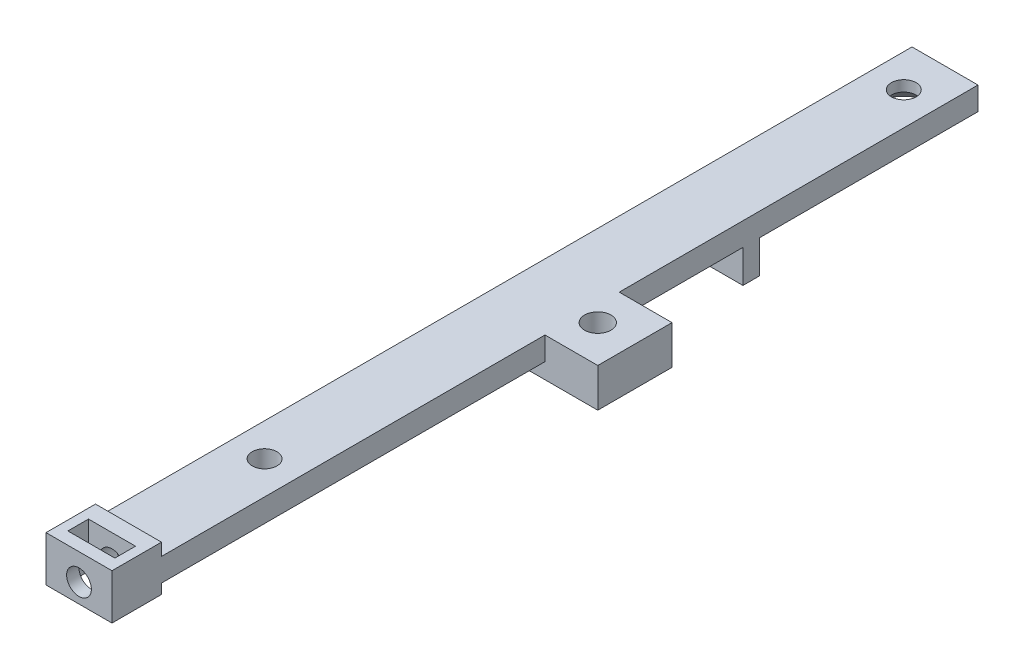
ISO-10303-21;
HEADER;
FILE_DESCRIPTION(('STEP AP214'),'2;1');
FILE_NAME('part.step','',(''),(''),'','','');
FILE_SCHEMA(('AUTOMOTIVE_DESIGN { 1 0 10303 214 1 1 1 1 }'));
ENDSEC;
DATA;
#1=APPLICATION_CONTEXT('core data for automotive mechanical design processes');
#2=APPLICATION_PROTOCOL_DEFINITION('international standard','automotive_design',2000,#1);
#3=PRODUCT_CONTEXT('',#1,'mechanical');
#4=PRODUCT('Part','Part','',(#3));
#5=PRODUCT_RELATED_PRODUCT_CATEGORY('part','',(#4));
#6=PRODUCT_DEFINITION_FORMATION('','',#4);
#7=PRODUCT_DEFINITION_CONTEXT('part definition',#1,'design');
#8=PRODUCT_DEFINITION('design','',#6,#7);
#9=PRODUCT_DEFINITION_SHAPE('','',#8);
#10=(LENGTH_UNIT() NAMED_UNIT(*) SI_UNIT(.MILLI.,.METRE.));
#11=(NAMED_UNIT(*) PLANE_ANGLE_UNIT() SI_UNIT($,.RADIAN.));
#12=(NAMED_UNIT(*) SI_UNIT($,.STERADIAN.) SOLID_ANGLE_UNIT());
#13=UNCERTAINTY_MEASURE_WITH_UNIT(LENGTH_MEASURE(1.E-05),#10,'distance_accuracy_value','');
#14=(GEOMETRIC_REPRESENTATION_CONTEXT(3) GLOBAL_UNCERTAINTY_ASSIGNED_CONTEXT((#13)) GLOBAL_UNIT_ASSIGNED_CONTEXT((#10,
#11,#12)) REPRESENTATION_CONTEXT('',''));
#15=CARTESIAN_POINT('',(0.,0.,0.));
#16=DIRECTION('',(0.,0.,1.));
#17=DIRECTION('',(1.,0.,0.));
#18=AXIS2_PLACEMENT_3D('',#15,#16,#17);
#19=CARTESIAN_POINT('',(0.,0.,0.));
#20=DIRECTION('',(0.,-1.,0.));
#21=DIRECTION('',(0.,0.,-1.));
#22=AXIS2_PLACEMENT_3D('',#19,#20,#21);
#23=PLANE('',#22);
#24=DIRECTION('',(0.,0.,1.));
#25=VECTOR('',#24,1.);
#26=CARTESIAN_POINT('',(0.,0.,0.));
#27=LINE('',#26,#25);
#28=CARTESIAN_POINT('',(0.,0.,-76.5));
#29=VERTEX_POINT('',#28);
#30=CARTESIAN_POINT('',(0.,0.,-61.5));
#31=VERTEX_POINT('',#30);
#32=EDGE_CURVE('E363',#29,#31,#27,.T.);
#33=ORIENTED_EDGE('',*,*,#32,.F.);
#34=DIRECTION('',(-1.,0.,0.));
#35=VECTOR('',#34,1.);
#36=CARTESIAN_POINT('',(8.,0.,-76.5));
#37=LINE('',#36,#35);
#38=CARTESIAN_POINT('',(8.,0.,-76.5));
#39=VERTEX_POINT('',#38);
#40=EDGE_CURVE('E448',#39,#29,#37,.T.);
#41=ORIENTED_EDGE('',*,*,#40,.F.);
#42=DIRECTION('',(0.,0.,-1.));
#43=VECTOR('',#42,1.);
#44=CARTESIAN_POINT('',(8.,0.,-55.));
#45=LINE('',#44,#43);
#46=CARTESIAN_POINT('',(8.,0.,-61.5));
#47=VERTEX_POINT('',#46);
#48=EDGE_CURVE('E214',#47,#39,#45,.T.);
#49=ORIENTED_EDGE('',*,*,#48,.F.);
#50=DIRECTION('',(1.,0.,0.));
#51=VECTOR('',#50,1.);
#52=CARTESIAN_POINT('',(0.,0.,-61.5));
#53=LINE('',#52,#51);
#54=EDGE_CURVE('E262',#31,#47,#53,.T.);
#55=ORIENTED_EDGE('',*,*,#54,.F.);
#56=EDGE_LOOP('',(#33,#41,#49,#55));
#57=FACE_BOUND('',#56,.T.);
#58=ADVANCED_FACE('F32',(#57),#23,.T.);
#59=CARTESIAN_POINT('',(4.,0.,-100.));
#60=DIRECTION('',(0.,-1.,0.));
#61=DIRECTION('',(0.,0.,-1.));
#62=AXIS2_PLACEMENT_3D('',#59,#60,#61);
#63=CIRCLE('',#62,2.99999999999999);
#64=CARTESIAN_POINT('',(4.,0.,-103.));
#65=VERTEX_POINT('',#64);
#66=EDGE_CURVE('E373',#65,#65,#63,.F.);
#67=ORIENTED_EDGE('',*,*,#66,.T.);
#68=EDGE_LOOP('',(#67));
#69=FACE_BOUND('',#68,.T.);
#70=CARTESIAN_POINT('',(8.,0.,-78.5));
#71=VERTEX_POINT('',#70);
#72=CARTESIAN_POINT('',(8.,0.,-105.));
#73=VERTEX_POINT('',#72);
#74=EDGE_CURVE('E343',#71,#73,#45,.T.);
#75=ORIENTED_EDGE('',*,*,#74,.F.);
#76=DIRECTION('',(1.,0.,0.));
#77=VECTOR('',#76,1.);
#78=CARTESIAN_POINT('',(8.,0.,-78.5));
#79=LINE('',#78,#77);
#80=CARTESIAN_POINT('',(0.,0.,-78.5));
#81=VERTEX_POINT('',#80);
#82=EDGE_CURVE('E207',#81,#71,#79,.T.);
#83=ORIENTED_EDGE('',*,*,#82,.F.);
#84=CARTESIAN_POINT('',(0.,0.,-105.));
#85=VERTEX_POINT('',#84);
#86=EDGE_CURVE('E360',#85,#81,#27,.T.);
#87=ORIENTED_EDGE('',*,*,#86,.F.);
#88=DIRECTION('',(-1.,0.,0.));
#89=VECTOR('',#88,1.);
#90=CARTESIAN_POINT('',(0.,0.,-105.));
#91=LINE('',#90,#89);
#92=EDGE_CURVE('E356',#73,#85,#91,.T.);
#93=ORIENTED_EDGE('',*,*,#92,.F.);
#94=EDGE_LOOP('',(#75,#83,#87,#93));
#95=FACE_BOUND('',#94,.T.);
#96=ADVANCED_FACE('F402',(#69,#95),#23,.T.);
#97=CARTESIAN_POINT('',(4.,0.,-22.5));
#98=DIRECTION('',(0.,-1.,0.));
#99=DIRECTION('',(0.,0.,-1.));
#100=AXIS2_PLACEMENT_3D('',#97,#98,#99);
#101=CIRCLE('',#100,1.5);
#102=CARTESIAN_POINT('',(4.,0.,-24.));
#103=VERTEX_POINT('',#102);
#104=EDGE_CURVE('E215',#103,#103,#101,.F.);
#105=ORIENTED_EDGE('',*,*,#104,.T.);
#106=EDGE_LOOP('',(#105));
#107=FACE_BOUND('',#106,.T.);
#108=DIRECTION('',(-1.,0.,0.));
#109=VECTOR('',#108,1.);
#110=CARTESIAN_POINT('',(0.,0.,-52.5));
#111=LINE('',#110,#109);
#112=CARTESIAN_POINT('',(8.,0.,-52.5));
#113=VERTEX_POINT('',#112);
#114=CARTESIAN_POINT('',(0.,0.,-52.5));
#115=VERTEX_POINT('',#114);
#116=EDGE_CURVE('E267',#113,#115,#111,.T.);
#117=ORIENTED_EDGE('',*,*,#116,.F.);
#118=CARTESIAN_POINT('',(8.00000000000001,0.,-6.));
#119=VERTEX_POINT('',#118);
#120=EDGE_CURVE('E353',#119,#113,#45,.T.);
#121=ORIENTED_EDGE('',*,*,#120,.F.);
#122=DIRECTION('',(-1.,0.,0.));
#123=VECTOR('',#122,1.);
#124=CARTESIAN_POINT('',(0.,0.,-6.));
#125=LINE('',#124,#123);
#126=CARTESIAN_POINT('',(5.01980390271856,0.,-6.));
#127=VERTEX_POINT('',#126);
#128=EDGE_CURVE('E11',#119,#127,#125,.T.);
#129=ORIENTED_EDGE('',*,*,#128,.T.);
#130=CARTESIAN_POINT('',(2.98019609728145,0.,-6.));
#131=VERTEX_POINT('',#130);
#132=EDGE_CURVE('E41',#127,#131,#125,.T.);
#133=ORIENTED_EDGE('',*,*,#132,.T.);
#134=CARTESIAN_POINT('',(0.,0.,-6.));
#135=VERTEX_POINT('',#134);
#136=EDGE_CURVE('E43',#131,#135,#125,.T.);
#137=ORIENTED_EDGE('',*,*,#136,.T.);
#138=EDGE_CURVE('E359',#115,#135,#27,.T.);
#139=ORIENTED_EDGE('',*,*,#138,.F.);
#140=EDGE_LOOP('',(#117,#121,#129,#133,#137,#139));
#141=FACE_BOUND('',#140,.T.);
#142=ADVANCED_FACE('F405',(#107,#141),#23,.T.);
#143=CARTESIAN_POINT('',(8.,2.8,-55.));
#144=DIRECTION('',(-1.,0.,0.));
#145=DIRECTION('',(0.,0.,1.));
#146=AXIS2_PLACEMENT_3D('',#143,#144,#145);
#147=PLANE('',#146);
#148=ORIENTED_EDGE('',*,*,#120,.T.);
#149=DIRECTION('',(0.,1.,0.));
#150=VECTOR('',#149,1.);
#151=CARTESIAN_POINT('',(8.,2.8,-52.5));
#152=LINE('',#151,#150);
#153=CARTESIAN_POINT('',(8.,2.8,-52.5));
#154=VERTEX_POINT('',#153);
#155=EDGE_CURVE('E264',#113,#154,#152,.T.);
#156=ORIENTED_EDGE('',*,*,#155,.T.);
#157=DIRECTION('',(0.,0.,-1.));
#158=VECTOR('',#157,1.);
#159=CARTESIAN_POINT('',(8.00000000000001,2.8,0.));
#160=LINE('',#159,#158);
#161=CARTESIAN_POINT('',(8.00000000000001,2.8,-6.));
#162=VERTEX_POINT('',#161);
#163=EDGE_CURVE('E344',#162,#154,#160,.T.);
#164=ORIENTED_EDGE('',*,*,#163,.F.);
#165=DIRECTION('',(0.,1.,0.));
#166=VECTOR('',#165,1.);
#167=CARTESIAN_POINT('',(8.00000000000001,-1.2,-6.));
#168=LINE('',#167,#166);
#169=CARTESIAN_POINT('',(8.00000000000001,4.3,-6.));
#170=VERTEX_POINT('',#169);
#171=EDGE_CURVE('E329',#162,#170,#168,.T.);
#172=ORIENTED_EDGE('',*,*,#171,.T.);
#173=DIRECTION('',(0.,0.,1.));
#174=VECTOR('',#173,1.);
#175=CARTESIAN_POINT('',(8.00000000000001,4.3,0.));
#176=LINE('',#175,#174);
#177=CARTESIAN_POINT('',(8.00000000000001,4.3,0.));
#178=VERTEX_POINT('',#177);
#179=EDGE_CURVE('E312',#170,#178,#176,.T.);
#180=ORIENTED_EDGE('',*,*,#179,.T.);
#181=DIRECTION('',(0.,-1.,0.));
#182=VECTOR('',#181,1.);
#183=CARTESIAN_POINT('',(8.00000000000001,2.8,0.));
#184=LINE('',#183,#182);
#185=CARTESIAN_POINT('',(8.00000000000001,-1.2,0.));
#186=VERTEX_POINT('',#185);
#187=EDGE_CURVE('E371',#178,#186,#184,.T.);
#188=ORIENTED_EDGE('',*,*,#187,.T.);
#189=DIRECTION('',(0.,0.,1.));
#190=VECTOR('',#189,1.);
#191=CARTESIAN_POINT('',(8.00000000000001,-1.2,0.));
#192=LINE('',#191,#190);
#193=CARTESIAN_POINT('',(8.00000000000001,-1.2,-6.));
#194=VERTEX_POINT('',#193);
#195=EDGE_CURVE('E323',#194,#186,#192,.T.);
#196=ORIENTED_EDGE('',*,*,#195,.F.);
#197=EDGE_CURVE('E330',#194,#119,#168,.T.);
#198=ORIENTED_EDGE('',*,*,#197,.T.);
#199=EDGE_LOOP('',(#148,#156,#164,#172,#180,#188,#196,#198));
#200=FACE_BOUND('',#199,.T.);
#201=ADVANCED_FACE('F414',(#200),#147,.F.);
#202=CARTESIAN_POINT('',(4.,1.1,-10.2426406871193));
#203=DIRECTION('',(0.,0.,1.));
#204=DIRECTION('',(1.,0.,0.));
#205=AXIS2_PLACEMENT_3D('',#202,#203,#204);
#206=CYLINDRICAL_SURFACE('',#205,1.5);
#207=CARTESIAN_POINT('',(4.,1.1,-4.));
#208=DIRECTION('',(0.,0.,-1.));
#209=DIRECTION('',(-1.,0.,0.));
#210=AXIS2_PLACEMENT_3D('',#207,#208,#209);
#211=CIRCLE('',#210,1.5);
#212=CARTESIAN_POINT('',(2.5,1.1,-4.));
#213=VERTEX_POINT('',#212);
#214=EDGE_CURVE('E36',#213,#213,#211,.F.);
#215=ORIENTED_EDGE('',*,*,#214,.T.);
#216=EDGE_LOOP('',(#215));
#217=FACE_BOUND('',#216,.T.);
#218=CARTESIAN_POINT('',(4.,1.1,-6.));
#219=DIRECTION('',(0.,0.,1.));
#220=DIRECTION('',(1.,0.,0.));
#221=AXIS2_PLACEMENT_3D('',#218,#219,#220);
#222=CIRCLE('',#221,1.5);
#223=EDGE_CURVE('E303',#127,#131,#222,.F.);
#224=ORIENTED_EDGE('',*,*,#223,.T.);
#225=EDGE_CURVE('E302',#131,#127,#222,.F.);
#226=ORIENTED_EDGE('',*,*,#225,.T.);
#227=EDGE_LOOP('',(#224,#226));
#228=FACE_BOUND('',#227,.T.);
#229=ADVANCED_FACE('F419',(#217,#228),#206,.F.);
#230=CARTESIAN_POINT('',(0.,2.8,0.));
#231=DIRECTION('',(0.,-1.,0.));
#232=DIRECTION('',(0.,0.,-1.));
#233=AXIS2_PLACEMENT_3D('',#230,#231,#232);
#234=PLANE('',#233);
#235=CARTESIAN_POINT('',(4.,2.8,-22.5));
#236=DIRECTION('',(0.,-1.,0.));
#237=DIRECTION('',(0.,0.,-1.));
#238=AXIS2_PLACEMENT_3D('',#235,#236,#237);
#239=CIRCLE('',#238,1.5);
#240=CARTESIAN_POINT('',(4.,2.8,-24.));
#241=VERTEX_POINT('',#240);
#242=EDGE_CURVE('E218',#241,#241,#239,.F.);
#243=ORIENTED_EDGE('',*,*,#242,.F.);
#244=EDGE_LOOP('',(#243));
#245=FACE_BOUND('',#244,.T.);
#246=CARTESIAN_POINT('',(9.90000000000001,2.8,-57.));
#247=DIRECTION('',(0.,-1.,0.));
#248=DIRECTION('',(0.,0.,-1.));
#249=AXIS2_PLACEMENT_3D('',#246,#247,#248);
#250=CIRCLE('',#249,1.6);
#251=CARTESIAN_POINT('',(9.90000000000001,2.8,-58.6));
#252=VERTEX_POINT('',#251);
#253=EDGE_CURVE('E229',#252,#252,#250,.F.);
#254=ORIENTED_EDGE('',*,*,#253,.F.);
#255=EDGE_LOOP('',(#254));
#256=FACE_BOUND('',#255,.T.);
#257=CARTESIAN_POINT('',(4.,2.8,-100.));
#258=DIRECTION('',(0.,1.,0.));
#259=DIRECTION('',(0.,0.,1.));
#260=AXIS2_PLACEMENT_3D('',#257,#258,#259);
#261=CIRCLE('',#260,1.5);
#262=CARTESIAN_POINT('',(4.,2.8,-98.5));
#263=VERTEX_POINT('',#262);
#264=EDGE_CURVE('E340',#263,#263,#261,.T.);
#265=ORIENTED_EDGE('',*,*,#264,.F.);
#266=EDGE_LOOP('',(#265));
#267=FACE_BOUND('',#266,.T.);
#268=DIRECTION('',(0.,0.,1.));
#269=VECTOR('',#268,1.);
#270=CARTESIAN_POINT('',(0.,2.8,-55.));
#271=LINE('',#270,#269);
#272=CARTESIAN_POINT('',(0.,2.8,-105.));
#273=VERTEX_POINT('',#272);
#274=CARTESIAN_POINT('',(0.,2.8,-6.));
#275=VERTEX_POINT('',#274);
#276=EDGE_CURVE('E350',#273,#275,#271,.T.);
#277=ORIENTED_EDGE('',*,*,#276,.T.);
#278=DIRECTION('',(-1.,0.,0.));
#279=VECTOR('',#278,1.);
#280=CARTESIAN_POINT('',(0.,2.8,-6.));
#281=LINE('',#280,#279);
#282=EDGE_CURVE('E337',#162,#275,#281,.T.);
#283=ORIENTED_EDGE('',*,*,#282,.F.);
#284=ORIENTED_EDGE('',*,*,#163,.T.);
#285=DIRECTION('',(1.,0.,0.));
#286=VECTOR('',#285,1.);
#287=CARTESIAN_POINT('',(14.4,2.8,-52.5));
#288=LINE('',#287,#286);
#289=CARTESIAN_POINT('',(14.4,2.8,-52.5));
#290=VERTEX_POINT('',#289);
#291=EDGE_CURVE('E237',#154,#290,#288,.T.);
#292=ORIENTED_EDGE('',*,*,#291,.T.);
#293=DIRECTION('',(0.,0.,-1.));
#294=VECTOR('',#293,1.);
#295=CARTESIAN_POINT('',(14.4,2.8,-61.5));
#296=LINE('',#295,#294);
#297=CARTESIAN_POINT('',(14.4,2.8,-61.5));
#298=VERTEX_POINT('',#297);
#299=EDGE_CURVE('E232',#290,#298,#296,.T.);
#300=ORIENTED_EDGE('',*,*,#299,.T.);
#301=DIRECTION('',(-1.,0.,0.));
#302=VECTOR('',#301,1.);
#303=CARTESIAN_POINT('',(14.4,2.8,-61.5));
#304=LINE('',#303,#302);
#305=CARTESIAN_POINT('',(8.,2.8,-61.5));
#306=VERTEX_POINT('',#305);
#307=EDGE_CURVE('E58',#298,#306,#304,.T.);
#308=ORIENTED_EDGE('',*,*,#307,.T.);
#309=CARTESIAN_POINT('',(8.,2.8,-105.));
#310=VERTEX_POINT('',#309);
#311=EDGE_CURVE('E348',#306,#310,#160,.T.);
#312=ORIENTED_EDGE('',*,*,#311,.T.);
#313=DIRECTION('',(-1.,0.,0.));
#314=VECTOR('',#313,1.);
#315=CARTESIAN_POINT('',(8.,2.8,-105.));
#316=LINE('',#315,#314);
#317=EDGE_CURVE('E347',#310,#273,#316,.T.);
#318=ORIENTED_EDGE('',*,*,#317,.T.);
#319=EDGE_LOOP('',(#277,#283,#284,#292,#300,#308,#312,#318));
#320=FACE_BOUND('',#319,.T.);
#321=ADVANCED_FACE('F460',(#245,#256,#267,#320),#234,.F.);
#322=CARTESIAN_POINT('',(8.00000000000001,2.8,0.));
#323=DIRECTION('',(0.,0.,-1.));
#324=DIRECTION('',(-1.,0.,0.));
#325=AXIS2_PLACEMENT_3D('',#322,#323,#324);
#326=PLANE('',#325);
#327=CARTESIAN_POINT('',(4.,1.1,0.));
#328=DIRECTION('',(0.,0.,1.));
#329=DIRECTION('',(1.,0.,0.));
#330=AXIS2_PLACEMENT_3D('',#327,#328,#329);
#331=CIRCLE('',#330,1.5);
#332=CARTESIAN_POINT('',(5.5,1.1,0.));
#333=VERTEX_POINT('',#332);
#334=EDGE_CURVE('E299',#333,#333,#331,.T.);
#335=ORIENTED_EDGE('',*,*,#334,.F.);
#336=EDGE_LOOP('',(#335));
#337=FACE_BOUND('',#336,.T.);
#338=DIRECTION('',(0.,-1.,0.));
#339=VECTOR('',#338,1.);
#340=CARTESIAN_POINT('',(0.,2.8,0.));
#341=LINE('',#340,#339);
#342=CARTESIAN_POINT('',(0.,4.3,0.));
#343=VERTEX_POINT('',#342);
#344=CARTESIAN_POINT('',(0.,-1.2,0.));
#345=VERTEX_POINT('',#344);
#346=EDGE_CURVE('E352',#343,#345,#341,.T.);
#347=ORIENTED_EDGE('',*,*,#346,.T.);
#348=DIRECTION('',(-1.,0.,0.));
#349=VECTOR('',#348,1.);
#350=CARTESIAN_POINT('',(0.,-1.2,0.));
#351=LINE('',#350,#349);
#352=EDGE_CURVE('E326',#186,#345,#351,.T.);
#353=ORIENTED_EDGE('',*,*,#352,.F.);
#354=ORIENTED_EDGE('',*,*,#187,.F.);
#355=DIRECTION('',(-1.,0.,0.));
#356=VECTOR('',#355,1.);
#357=CARTESIAN_POINT('',(0.,4.3,0.));
#358=LINE('',#357,#356);
#359=EDGE_CURVE('E315',#178,#343,#358,.T.);
#360=ORIENTED_EDGE('',*,*,#359,.T.);
#361=EDGE_LOOP('',(#347,#353,#354,#360));
#362=FACE_BOUND('',#361,.T.);
#363=ADVANCED_FACE('F509',(#337,#362),#326,.F.);
#364=ORIENTED_EDGE('',*,*,#311,.F.);
#365=DIRECTION('',(0.,-1.,0.));
#366=VECTOR('',#365,1.);
#367=CARTESIAN_POINT('',(8.,2.8,-61.5));
#368=LINE('',#367,#366);
#369=EDGE_CURVE('E253',#306,#47,#368,.T.);
#370=ORIENTED_EDGE('',*,*,#369,.T.);
#371=ORIENTED_EDGE('',*,*,#48,.T.);
#372=DIRECTION('',(0.,1.,0.));
#373=VECTOR('',#372,1.);
#374=CARTESIAN_POINT('',(8.,-4.,-76.5));
#375=LINE('',#374,#373);
#376=CARTESIAN_POINT('',(8.,-4.,-76.5));
#377=VERTEX_POINT('',#376);
#378=EDGE_CURVE('E194',#377,#39,#375,.T.);
#379=ORIENTED_EDGE('',*,*,#378,.F.);
#380=DIRECTION('',(0.,0.,1.));
#381=VECTOR('',#380,1.);
#382=CARTESIAN_POINT('',(8.,-4.,-78.5));
#383=LINE('',#382,#381);
#384=CARTESIAN_POINT('',(8.,-4.,-78.5));
#385=VERTEX_POINT('',#384);
#386=EDGE_CURVE('E198',#385,#377,#383,.T.);
#387=ORIENTED_EDGE('',*,*,#386,.F.);
#388=DIRECTION('',(0.,1.,0.));
#389=VECTOR('',#388,1.);
#390=CARTESIAN_POINT('',(8.,-4.,-78.5));
#391=LINE('',#390,#389);
#392=EDGE_CURVE('E453',#385,#71,#391,.T.);
#393=ORIENTED_EDGE('',*,*,#392,.T.);
#394=ORIENTED_EDGE('',*,*,#74,.T.);
#395=DIRECTION('',(0.,-1.,0.));
#396=VECTOR('',#395,1.);
#397=CARTESIAN_POINT('',(8.,2.8,-105.));
#398=LINE('',#397,#396);
#399=EDGE_CURVE('E368',#310,#73,#398,.T.);
#400=ORIENTED_EDGE('',*,*,#399,.F.);
#401=EDGE_LOOP('',(#364,#370,#371,#379,#387,#393,#394,#400));
#402=FACE_BOUND('',#401,.T.);
#403=ADVANCED_FACE('F211',(#402),#147,.F.);
#404=CARTESIAN_POINT('',(0.,2.8,-105.));
#405=DIRECTION('',(0.,0.,1.));
#406=DIRECTION('',(1.,0.,0.));
#407=AXIS2_PLACEMENT_3D('',#404,#405,#406);
#408=PLANE('',#407);
#409=ORIENTED_EDGE('',*,*,#92,.T.);
#410=DIRECTION('',(0.,-1.,0.));
#411=VECTOR('',#410,1.);
#412=CARTESIAN_POINT('',(0.,2.8,-105.));
#413=LINE('',#412,#411);
#414=EDGE_CURVE('E365',#273,#85,#413,.T.);
#415=ORIENTED_EDGE('',*,*,#414,.F.);
#416=ORIENTED_EDGE('',*,*,#317,.F.);
#417=ORIENTED_EDGE('',*,*,#399,.T.);
#418=EDGE_LOOP('',(#409,#415,#416,#417));
#419=FACE_BOUND('',#418,.T.);
#420=ADVANCED_FACE('F458',(#419),#408,.F.);
#421=CARTESIAN_POINT('',(0.,2.8,0.));
#422=DIRECTION('',(1.,0.,0.));
#423=DIRECTION('',(0.,0.,-1.));
#424=AXIS2_PLACEMENT_3D('',#421,#422,#423);
#425=PLANE('',#424);
#426=ORIENTED_EDGE('',*,*,#86,.T.);
#427=DIRECTION('',(0.,1.,0.));
#428=VECTOR('',#427,1.);
#429=CARTESIAN_POINT('',(0.,-4.,-78.5));
#430=LINE('',#429,#428);
#431=CARTESIAN_POINT('',(0.,-4.,-78.5));
#432=VERTEX_POINT('',#431);
#433=EDGE_CURVE('E220',#432,#81,#430,.T.);
#434=ORIENTED_EDGE('',*,*,#433,.F.);
#435=DIRECTION('',(0.,0.,-1.));
#436=VECTOR('',#435,1.);
#437=CARTESIAN_POINT('',(0.,-4.,-78.5));
#438=LINE('',#437,#436);
#439=CARTESIAN_POINT('',(0.,-4.,-76.5));
#440=VERTEX_POINT('',#439);
#441=EDGE_CURVE('E197',#440,#432,#438,.T.);
#442=ORIENTED_EDGE('',*,*,#441,.F.);
#443=DIRECTION('',(0.,1.,0.));
#444=VECTOR('',#443,1.);
#445=CARTESIAN_POINT('',(0.,-4.,-76.5));
#446=LINE('',#445,#444);
#447=EDGE_CURVE('E50',#440,#29,#446,.T.);
#448=ORIENTED_EDGE('',*,*,#447,.T.);
#449=ORIENTED_EDGE('',*,*,#32,.T.);
#450=DIRECTION('',(0.,1.,0.));
#451=VECTOR('',#450,1.);
#452=CARTESIAN_POINT('',(0.,-1.9,-61.5));
#453=LINE('',#452,#451);
#454=CARTESIAN_POINT('',(0.,-1.9,-61.5));
#455=VERTEX_POINT('',#454);
#456=EDGE_CURVE('E257',#455,#31,#453,.T.);
#457=ORIENTED_EDGE('',*,*,#456,.F.);
#458=DIRECTION('',(0.,0.,1.));
#459=VECTOR('',#458,1.);
#460=CARTESIAN_POINT('',(0.,-1.9,-61.5));
#461=LINE('',#460,#459);
#462=CARTESIAN_POINT('',(0.,-1.9,-52.5));
#463=VERTEX_POINT('',#462);
#464=EDGE_CURVE('E240',#455,#463,#461,.T.);
#465=ORIENTED_EDGE('',*,*,#464,.T.);
#466=DIRECTION('',(0.,1.,0.));
#467=VECTOR('',#466,1.);
#468=CARTESIAN_POINT('',(0.,-1.9,-52.5));
#469=LINE('',#468,#467);
#470=EDGE_CURVE('E254',#463,#115,#469,.T.);
#471=ORIENTED_EDGE('',*,*,#470,.T.);
#472=ORIENTED_EDGE('',*,*,#138,.T.);
#473=DIRECTION('',(0.,1.,0.));
#474=VECTOR('',#473,1.);
#475=CARTESIAN_POINT('',(0.,-1.2,-6.));
#476=LINE('',#475,#474);
#477=CARTESIAN_POINT('',(0.,-1.2,-6.));
#478=VERTEX_POINT('',#477);
#479=EDGE_CURVE('E334',#478,#135,#476,.T.);
#480=ORIENTED_EDGE('',*,*,#479,.F.);
#481=DIRECTION('',(0.,0.,-1.));
#482=VECTOR('',#481,1.);
#483=CARTESIAN_POINT('',(0.,-1.2,0.));
#484=LINE('',#483,#482);
#485=EDGE_CURVE('E318',#345,#478,#484,.T.);
#486=ORIENTED_EDGE('',*,*,#485,.F.);
#487=ORIENTED_EDGE('',*,*,#346,.F.);
#488=DIRECTION('',(0.,0.,-1.));
#489=VECTOR('',#488,1.);
#490=CARTESIAN_POINT('',(0.,4.3,0.));
#491=LINE('',#490,#489);
#492=CARTESIAN_POINT('',(0.,4.3,-6.));
#493=VERTEX_POINT('',#492);
#494=EDGE_CURVE('E306',#343,#493,#491,.T.);
#495=ORIENTED_EDGE('',*,*,#494,.T.);
#496=EDGE_CURVE('E333',#275,#493,#476,.T.);
#497=ORIENTED_EDGE('',*,*,#496,.F.);
#498=ORIENTED_EDGE('',*,*,#276,.F.);
#499=ORIENTED_EDGE('',*,*,#414,.T.);
#500=EDGE_LOOP('',(#426,#434,#442,#448,#449,#457,#465,#471,#472,#480,#486,#487,#495,#497,#498,#499));
#501=FACE_BOUND('',#500,.T.);
#502=ADVANCED_FACE('F442',(#501),#425,.F.);
#503=CARTESIAN_POINT('',(4.,-0.00100000000000013,-100.));
#504=DIRECTION('',(0.,1.,0.));
#505=DIRECTION('',(0.,0.,1.));
#506=AXIS2_PLACEMENT_3D('',#503,#504,#505);
#507=CYLINDRICAL_SURFACE('',#506,1.5);
#508=CARTESIAN_POINT('',(4.,1.49999999999998,-100.));
#509=DIRECTION('',(0.,-1.,0.));
#510=DIRECTION('',(0.,0.,-1.));
#511=AXIS2_PLACEMENT_3D('',#508,#509,#510);
#512=CIRCLE('',#511,1.5);
#513=CARTESIAN_POINT('',(4.,1.49999999999998,-101.5));
#514=VERTEX_POINT('',#513);
#515=EDGE_CURVE('E376',#514,#514,#512,.T.);
#516=ORIENTED_EDGE('',*,*,#515,.T.);
#517=EDGE_LOOP('',(#516));
#518=FACE_BOUND('',#517,.T.);
#519=ORIENTED_EDGE('',*,*,#264,.T.);
#520=EDGE_LOOP('',(#519));
#521=FACE_BOUND('',#520,.T.);
#522=ADVANCED_FACE('F528',(#518,#521),#507,.F.);
#523=CARTESIAN_POINT('',(4.,0.,-100.));
#524=DIRECTION('',(0.,-1.,0.));
#525=DIRECTION('',(0.,0.,-1.));
#526=AXIS2_PLACEMENT_3D('',#523,#524,#525);
#527=CONICAL_SURFACE('',#526,2.99999999999999,0.785398163397451);
#528=ORIENTED_EDGE('',*,*,#515,.F.);
#529=EDGE_LOOP('',(#528));
#530=FACE_BOUND('',#529,.T.);
#531=ORIENTED_EDGE('',*,*,#66,.F.);
#532=EDGE_LOOP('',(#531));
#533=FACE_BOUND('',#532,.T.);
#534=ADVANCED_FACE('F34',(#530,#533),#527,.F.);
#535=CARTESIAN_POINT('',(0.,-1.2,0.));
#536=DIRECTION('',(0.,-1.,0.));
#537=DIRECTION('',(0.,0.,-1.));
#538=AXIS2_PLACEMENT_3D('',#535,#536,#537);
#539=PLANE('',#538);
#540=DIRECTION('',(0.,0.,-1.));
#541=VECTOR('',#540,1.);
#542=CARTESIAN_POINT('',(1.15,-1.2,0.));
#543=LINE('',#542,#541);
#544=CARTESIAN_POINT('',(1.15,-1.2,-1.5));
#545=VERTEX_POINT('',#544);
#546=CARTESIAN_POINT('',(1.15,-1.2,-4.));
#547=VERTEX_POINT('',#546);
#548=EDGE_CURVE('E297',#545,#547,#543,.T.);
#549=ORIENTED_EDGE('',*,*,#548,.F.);
#550=DIRECTION('',(-1.,0.,0.));
#551=VECTOR('',#550,1.);
#552=CARTESIAN_POINT('',(0.,-1.2,-1.5));
#553=LINE('',#552,#551);
#554=CARTESIAN_POINT('',(6.85,-1.2,-1.5));
#555=VERTEX_POINT('',#554);
#556=EDGE_CURVE('E290',#555,#545,#553,.T.);
#557=ORIENTED_EDGE('',*,*,#556,.F.);
#558=DIRECTION('',(0.,0.,1.));
#559=VECTOR('',#558,1.);
#560=CARTESIAN_POINT('',(6.85000000000001,-1.2,0.));
#561=LINE('',#560,#559);
#562=CARTESIAN_POINT('',(6.85,-1.2,-4.));
#563=VERTEX_POINT('',#562);
#564=EDGE_CURVE('E294',#563,#555,#561,.T.);
#565=ORIENTED_EDGE('',*,*,#564,.F.);
#566=DIRECTION('',(1.,0.,0.));
#567=VECTOR('',#566,1.);
#568=CARTESIAN_POINT('',(0.,-1.2,-4.));
#569=LINE('',#568,#567);
#570=EDGE_CURVE('E292',#547,#563,#569,.T.);
#571=ORIENTED_EDGE('',*,*,#570,.F.);
#572=EDGE_LOOP('',(#549,#557,#565,#571));
#573=FACE_BOUND('',#572,.T.);
#574=ORIENTED_EDGE('',*,*,#485,.T.);
#575=DIRECTION('',(1.,0.,0.));
#576=VECTOR('',#575,1.);
#577=CARTESIAN_POINT('',(0.,-1.2,-6.));
#578=LINE('',#577,#576);
#579=EDGE_CURVE('E321',#478,#194,#578,.T.);
#580=ORIENTED_EDGE('',*,*,#579,.T.);
#581=ORIENTED_EDGE('',*,*,#195,.T.);
#582=ORIENTED_EDGE('',*,*,#352,.T.);
#583=EDGE_LOOP('',(#574,#580,#581,#582));
#584=FACE_BOUND('',#583,.T.);
#585=ADVANCED_FACE('F489',(#573,#584),#539,.T.);
#586=CARTESIAN_POINT('',(0.,-1.2,-6.));
#587=DIRECTION('',(0.,0.,1.));
#588=DIRECTION('',(1.,0.,0.));
#589=AXIS2_PLACEMENT_3D('',#586,#587,#588);
#590=PLANE('',#589);
#591=ORIENTED_EDGE('',*,*,#136,.F.);
#592=ORIENTED_EDGE('',*,*,#223,.F.);
#593=ORIENTED_EDGE('',*,*,#128,.F.);
#594=ORIENTED_EDGE('',*,*,#197,.F.);
#595=ORIENTED_EDGE('',*,*,#579,.F.);
#596=ORIENTED_EDGE('',*,*,#479,.T.);
#597=EDGE_LOOP('',(#591,#592,#593,#594,#595,#596));
#598=FACE_BOUND('',#597,.T.);
#599=ADVANCED_FACE('F434',(#598),#590,.F.);
#600=ORIENTED_EDGE('',*,*,#171,.F.);
#601=ORIENTED_EDGE('',*,*,#282,.T.);
#602=ORIENTED_EDGE('',*,*,#496,.T.);
#603=DIRECTION('',(1.,0.,0.));
#604=VECTOR('',#603,1.);
#605=CARTESIAN_POINT('',(0.,4.3,-6.));
#606=LINE('',#605,#604);
#607=EDGE_CURVE('E309',#493,#170,#606,.T.);
#608=ORIENTED_EDGE('',*,*,#607,.T.);
#609=EDGE_LOOP('',(#600,#601,#602,#608));
#610=FACE_BOUND('',#609,.T.);
#611=ADVANCED_FACE('F518',(#610),#590,.F.);
#612=CARTESIAN_POINT('',(0.,4.3,0.));
#613=DIRECTION('',(0.,-1.,0.));
#614=DIRECTION('',(0.,0.,-1.));
#615=AXIS2_PLACEMENT_3D('',#612,#613,#614);
#616=PLANE('',#615);
#617=DIRECTION('',(1.,0.,0.));
#618=VECTOR('',#617,1.);
#619=CARTESIAN_POINT('',(1.15,4.3,-1.5));
#620=LINE('',#619,#618);
#621=CARTESIAN_POINT('',(1.15,4.3,-1.5));
#622=VERTEX_POINT('',#621);
#623=CARTESIAN_POINT('',(6.85,4.3,-1.5));
#624=VERTEX_POINT('',#623);
#625=EDGE_CURVE('E271',#622,#624,#620,.T.);
#626=ORIENTED_EDGE('',*,*,#625,.F.);
#627=DIRECTION('',(0.,0.,1.));
#628=VECTOR('',#627,1.);
#629=CARTESIAN_POINT('',(1.15,4.3,-4.));
#630=LINE('',#629,#628);
#631=CARTESIAN_POINT('',(1.15,4.3,-4.));
#632=VERTEX_POINT('',#631);
#633=EDGE_CURVE('E269',#632,#622,#630,.T.);
#634=ORIENTED_EDGE('',*,*,#633,.F.);
#635=DIRECTION('',(-1.,0.,0.));
#636=VECTOR('',#635,1.);
#637=CARTESIAN_POINT('',(1.15,4.3,-4.));
#638=LINE('',#637,#636);
#639=CARTESIAN_POINT('',(6.85,4.3,-4.));
#640=VERTEX_POINT('',#639);
#641=EDGE_CURVE('E277',#640,#632,#638,.T.);
#642=ORIENTED_EDGE('',*,*,#641,.F.);
#643=DIRECTION('',(0.,0.,-1.));
#644=VECTOR('',#643,1.);
#645=CARTESIAN_POINT('',(6.85,4.3,-4.));
#646=LINE('',#645,#644);
#647=EDGE_CURVE('E274',#624,#640,#646,.T.);
#648=ORIENTED_EDGE('',*,*,#647,.F.);
#649=EDGE_LOOP('',(#626,#634,#642,#648));
#650=FACE_BOUND('',#649,.T.);
#651=ORIENTED_EDGE('',*,*,#494,.F.);
#652=ORIENTED_EDGE('',*,*,#359,.F.);
#653=ORIENTED_EDGE('',*,*,#179,.F.);
#654=ORIENTED_EDGE('',*,*,#607,.F.);
#655=EDGE_LOOP('',(#651,#652,#653,#654));
#656=FACE_BOUND('',#655,.T.);
#657=ADVANCED_FACE('F497',(#650,#656),#616,.F.);
#658=CARTESIAN_POINT('',(4.,1.1,-1.5));
#659=DIRECTION('',(0.,0.,1.));
#660=DIRECTION('',(1.,0.,0.));
#661=AXIS2_PLACEMENT_3D('',#658,#659,#660);
#662=CIRCLE('',#661,1.5);
#663=CARTESIAN_POINT('',(5.5,1.1,-1.5));
#664=VERTEX_POINT('',#663);
#665=EDGE_CURVE('E283',#664,#664,#662,.F.);
#666=ORIENTED_EDGE('',*,*,#665,.T.);
#667=EDGE_LOOP('',(#666));
#668=FACE_BOUND('',#667,.T.);
#669=ORIENTED_EDGE('',*,*,#334,.T.);
#670=EDGE_LOOP('',(#669));
#671=FACE_BOUND('',#670,.T.);
#672=ADVANCED_FACE('F381',(#668,#671),#206,.F.);
#673=CARTESIAN_POINT('',(0.,-1.2,-6.));
#674=DIRECTION('',(0.,0.,1.));
#675=DIRECTION('',(1.,0.,0.));
#676=AXIS2_PLACEMENT_3D('',#673,#674,#675);
#677=PLANE('',#676);
#678=ORIENTED_EDGE('',*,*,#225,.F.);
#679=ORIENTED_EDGE('',*,*,#132,.F.);
#680=EDGE_LOOP('',(#678,#679));
#681=FACE_BOUND('',#680,.T.);
#682=ADVANCED_FACE('F397',(#681),#677,.T.);
#683=CARTESIAN_POINT('',(1.15,-2.7,-4.));
#684=DIRECTION('',(0.,0.,-1.));
#685=DIRECTION('',(-1.,0.,0.));
#686=AXIS2_PLACEMENT_3D('',#683,#684,#685);
#687=PLANE('',#686);
#688=ORIENTED_EDGE('',*,*,#570,.T.);
#689=DIRECTION('',(0.,1.,0.));
#690=VECTOR('',#689,1.);
#691=CARTESIAN_POINT('',(6.85,-2.7,-4.));
#692=LINE('',#691,#690);
#693=EDGE_CURVE('E284',#563,#640,#692,.T.);
#694=ORIENTED_EDGE('',*,*,#693,.T.);
#695=ORIENTED_EDGE('',*,*,#641,.T.);
#696=DIRECTION('',(0.,1.,0.));
#697=VECTOR('',#696,1.);
#698=CARTESIAN_POINT('',(1.15,-2.7,-4.));
#699=LINE('',#698,#697);
#700=EDGE_CURVE('E281',#547,#632,#699,.T.);
#701=ORIENTED_EDGE('',*,*,#700,.F.);
#702=EDGE_LOOP('',(#688,#694,#695,#701));
#703=FACE_BOUND('',#702,.T.);
#704=ORIENTED_EDGE('',*,*,#214,.F.);
#705=EDGE_LOOP('',(#704));
#706=FACE_BOUND('',#705,.T.);
#707=ADVANCED_FACE('F387',(#703,#706),#687,.F.);
#708=CARTESIAN_POINT('',(1.15,-2.7,-1.5));
#709=DIRECTION('',(0.,0.,1.));
#710=DIRECTION('',(1.,0.,0.));
#711=AXIS2_PLACEMENT_3D('',#708,#709,#710);
#712=PLANE('',#711);
#713=ORIENTED_EDGE('',*,*,#556,.T.);
#714=DIRECTION('',(0.,1.,0.));
#715=VECTOR('',#714,1.);
#716=CARTESIAN_POINT('',(1.15,-2.7,-1.5));
#717=LINE('',#716,#715);
#718=EDGE_CURVE('E280',#545,#622,#717,.T.);
#719=ORIENTED_EDGE('',*,*,#718,.T.);
#720=ORIENTED_EDGE('',*,*,#625,.T.);
#721=DIRECTION('',(0.,1.,0.));
#722=VECTOR('',#721,1.);
#723=CARTESIAN_POINT('',(6.85,-2.7,-1.5));
#724=LINE('',#723,#722);
#725=EDGE_CURVE('E286',#555,#624,#724,.T.);
#726=ORIENTED_EDGE('',*,*,#725,.F.);
#727=EDGE_LOOP('',(#713,#719,#720,#726));
#728=FACE_BOUND('',#727,.T.);
#729=ORIENTED_EDGE('',*,*,#665,.F.);
#730=EDGE_LOOP('',(#729));
#731=FACE_BOUND('',#730,.T.);
#732=ADVANCED_FACE('F384',(#728,#731),#712,.F.);
#733=CARTESIAN_POINT('',(1.15,-2.7,-4.));
#734=DIRECTION('',(-1.,0.,0.));
#735=DIRECTION('',(0.,0.,1.));
#736=AXIS2_PLACEMENT_3D('',#733,#734,#735);
#737=PLANE('',#736);
#738=ORIENTED_EDGE('',*,*,#548,.T.);
#739=ORIENTED_EDGE('',*,*,#700,.T.);
#740=ORIENTED_EDGE('',*,*,#633,.T.);
#741=ORIENTED_EDGE('',*,*,#718,.F.);
#742=EDGE_LOOP('',(#738,#739,#740,#741));
#743=FACE_BOUND('',#742,.T.);
#744=ADVANCED_FACE('F386',(#743),#737,.F.);
#745=CARTESIAN_POINT('',(6.85,-2.7,-4.));
#746=DIRECTION('',(1.,0.,0.));
#747=DIRECTION('',(0.,0.,-1.));
#748=AXIS2_PLACEMENT_3D('',#745,#746,#747);
#749=PLANE('',#748);
#750=ORIENTED_EDGE('',*,*,#564,.T.);
#751=ORIENTED_EDGE('',*,*,#725,.T.);
#752=ORIENTED_EDGE('',*,*,#647,.T.);
#753=ORIENTED_EDGE('',*,*,#693,.F.);
#754=EDGE_LOOP('',(#750,#751,#752,#753));
#755=FACE_BOUND('',#754,.T.);
#756=ADVANCED_FACE('F394',(#755),#749,.F.);
#757=CARTESIAN_POINT('',(14.4,-1.9,-61.5));
#758=DIRECTION('',(1.,0.,0.));
#759=DIRECTION('',(0.,0.,-1.));
#760=AXIS2_PLACEMENT_3D('',#757,#758,#759);
#761=PLANE('',#760);
#762=ORIENTED_EDGE('',*,*,#299,.F.);
#763=DIRECTION('',(0.,1.,0.));
#764=VECTOR('',#763,1.);
#765=CARTESIAN_POINT('',(14.4,-1.9,-52.5));
#766=LINE('',#765,#764);
#767=CARTESIAN_POINT('',(14.4,-1.9,-52.5));
#768=VERTEX_POINT('',#767);
#769=EDGE_CURVE('E250',#768,#290,#766,.T.);
#770=ORIENTED_EDGE('',*,*,#769,.F.);
#771=DIRECTION('',(0.,0.,-1.));
#772=VECTOR('',#771,1.);
#773=CARTESIAN_POINT('',(14.4,-1.9,-61.5));
#774=LINE('',#773,#772);
#775=CARTESIAN_POINT('',(14.4,-1.9,-61.5));
#776=VERTEX_POINT('',#775);
#777=EDGE_CURVE('E233',#768,#776,#774,.T.);
#778=ORIENTED_EDGE('',*,*,#777,.T.);
#779=DIRECTION('',(0.,1.,0.));
#780=VECTOR('',#779,1.);
#781=CARTESIAN_POINT('',(14.4,-1.9,-61.5));
#782=LINE('',#781,#780);
#783=EDGE_CURVE('E246',#776,#298,#782,.T.);
#784=ORIENTED_EDGE('',*,*,#783,.T.);
#785=EDGE_LOOP('',(#762,#770,#778,#784));
#786=FACE_BOUND('',#785,.T.);
#787=ADVANCED_FACE('F463',(#786),#761,.T.);
#788=CARTESIAN_POINT('',(14.4,-1.9,-52.5));
#789=DIRECTION('',(0.,0.,1.));
#790=DIRECTION('',(1.,0.,0.));
#791=AXIS2_PLACEMENT_3D('',#788,#789,#790);
#792=PLANE('',#791);
#793=ORIENTED_EDGE('',*,*,#155,.F.);
#794=ORIENTED_EDGE('',*,*,#116,.T.);
#795=ORIENTED_EDGE('',*,*,#470,.F.);
#796=DIRECTION('',(1.,0.,0.));
#797=VECTOR('',#796,1.);
#798=CARTESIAN_POINT('',(14.4,-1.9,-52.5));
#799=LINE('',#798,#797);
#800=EDGE_CURVE('E243',#463,#768,#799,.T.);
#801=ORIENTED_EDGE('',*,*,#800,.T.);
#802=ORIENTED_EDGE('',*,*,#769,.T.);
#803=ORIENTED_EDGE('',*,*,#291,.F.);
#804=EDGE_LOOP('',(#793,#794,#795,#801,#802,#803));
#805=FACE_BOUND('',#804,.T.);
#806=ADVANCED_FACE('F468',(#805),#792,.T.);
#807=CARTESIAN_POINT('',(14.4,-1.9,-61.5));
#808=DIRECTION('',(0.,0.,-1.));
#809=DIRECTION('',(-1.,0.,0.));
#810=AXIS2_PLACEMENT_3D('',#807,#808,#809);
#811=PLANE('',#810);
#812=ORIENTED_EDGE('',*,*,#456,.T.);
#813=ORIENTED_EDGE('',*,*,#54,.T.);
#814=ORIENTED_EDGE('',*,*,#369,.F.);
#815=ORIENTED_EDGE('',*,*,#307,.F.);
#816=ORIENTED_EDGE('',*,*,#783,.F.);
#817=DIRECTION('',(-1.,0.,0.));
#818=VECTOR('',#817,1.);
#819=CARTESIAN_POINT('',(14.4,-1.9,-61.5));
#820=LINE('',#819,#818);
#821=EDGE_CURVE('E236',#776,#455,#820,.T.);
#822=ORIENTED_EDGE('',*,*,#821,.T.);
#823=EDGE_LOOP('',(#812,#813,#814,#815,#816,#822));
#824=FACE_BOUND('',#823,.T.);
#825=ADVANCED_FACE('F446',(#824),#811,.T.);
#826=CARTESIAN_POINT('',(0.,-1.9,0.));
#827=DIRECTION('',(0.,-1.,0.));
#828=DIRECTION('',(0.,0.,-1.));
#829=AXIS2_PLACEMENT_3D('',#826,#827,#828);
#830=PLANE('',#829);
#831=CARTESIAN_POINT('',(9.90000000000001,-1.9,-57.));
#832=DIRECTION('',(0.,-1.,0.));
#833=DIRECTION('',(0.,0.,-1.));
#834=AXIS2_PLACEMENT_3D('',#831,#832,#833);
#835=CIRCLE('',#834,1.6);
#836=CARTESIAN_POINT('',(9.90000000000001,-1.9,-58.6));
#837=VERTEX_POINT('',#836);
#838=EDGE_CURVE('E225',#837,#837,#835,.T.);
#839=ORIENTED_EDGE('',*,*,#838,.F.);
#840=EDGE_LOOP('',(#839));
#841=FACE_BOUND('',#840,.T.);
#842=ORIENTED_EDGE('',*,*,#777,.F.);
#843=ORIENTED_EDGE('',*,*,#800,.F.);
#844=ORIENTED_EDGE('',*,*,#464,.F.);
#845=ORIENTED_EDGE('',*,*,#821,.F.);
#846=EDGE_LOOP('',(#842,#843,#844,#845));
#847=FACE_BOUND('',#846,.T.);
#848=ADVANCED_FACE('F467',(#841,#847),#830,.T.);
#849=CARTESIAN_POINT('',(9.90000000000001,4.301,-57.));
#850=DIRECTION('',(0.,-1.,0.));
#851=DIRECTION('',(0.,0.,-1.));
#852=AXIS2_PLACEMENT_3D('',#849,#850,#851);
#853=CYLINDRICAL_SURFACE('',#852,1.6);
#854=ORIENTED_EDGE('',*,*,#838,.T.);
#855=EDGE_LOOP('',(#854));
#856=FACE_BOUND('',#855,.T.);
#857=ORIENTED_EDGE('',*,*,#253,.T.);
#858=EDGE_LOOP('',(#857));
#859=FACE_BOUND('',#858,.T.);
#860=ADVANCED_FACE('F579',(#856,#859),#853,.F.);
#861=CARTESIAN_POINT('',(4.,4.301,-22.5));
#862=DIRECTION('',(0.,-1.,0.));
#863=DIRECTION('',(0.,0.,-1.));
#864=AXIS2_PLACEMENT_3D('',#861,#862,#863);
#865=CYLINDRICAL_SURFACE('',#864,1.5);
#866=ORIENTED_EDGE('',*,*,#104,.F.);
#867=EDGE_LOOP('',(#866));
#868=FACE_BOUND('',#867,.T.);
#869=ORIENTED_EDGE('',*,*,#242,.T.);
#870=EDGE_LOOP('',(#869));
#871=FACE_BOUND('',#870,.T.);
#872=ADVANCED_FACE('F575',(#868,#871),#865,.F.);
#873=CARTESIAN_POINT('',(8.,-4.,-76.5));
#874=DIRECTION('',(0.,0.,-1.));
#875=DIRECTION('',(-1.,0.,0.));
#876=AXIS2_PLACEMENT_3D('',#873,#874,#875);
#877=PLANE('',#876);
#878=ORIENTED_EDGE('',*,*,#40,.T.);
#879=ORIENTED_EDGE('',*,*,#447,.F.);
#880=DIRECTION('',(-1.,0.,0.));
#881=VECTOR('',#880,1.);
#882=CARTESIAN_POINT('',(8.,-4.,-76.5));
#883=LINE('',#882,#881);
#884=EDGE_CURVE('E190',#377,#440,#883,.T.);
#885=ORIENTED_EDGE('',*,*,#884,.F.);
#886=ORIENTED_EDGE('',*,*,#378,.T.);
#887=EDGE_LOOP('',(#878,#879,#885,#886));
#888=FACE_BOUND('',#887,.T.);
#889=ADVANCED_FACE('F192',(#888),#877,.F.);
#890=CARTESIAN_POINT('',(8.,-4.,-78.5));
#891=DIRECTION('',(0.,0.,1.));
#892=DIRECTION('',(1.,0.,0.));
#893=AXIS2_PLACEMENT_3D('',#890,#891,#892);
#894=PLANE('',#893);
#895=ORIENTED_EDGE('',*,*,#82,.T.);
#896=ORIENTED_EDGE('',*,*,#392,.F.);
#897=DIRECTION('',(1.,0.,0.));
#898=VECTOR('',#897,1.);
#899=CARTESIAN_POINT('',(8.,-4.,-78.5));
#900=LINE('',#899,#898);
#901=EDGE_CURVE('E203',#432,#385,#900,.T.);
#902=ORIENTED_EDGE('',*,*,#901,.F.);
#903=ORIENTED_EDGE('',*,*,#433,.T.);
#904=EDGE_LOOP('',(#895,#896,#902,#903));
#905=FACE_BOUND('',#904,.T.);
#906=ADVANCED_FACE('F562',(#905),#894,.F.);
#907=CARTESIAN_POINT('',(0.,-4.,0.));
#908=DIRECTION('',(0.,-1.,0.));
#909=DIRECTION('',(0.,0.,-1.));
#910=AXIS2_PLACEMENT_3D('',#907,#908,#909);
#911=PLANE('',#910);
#912=ORIENTED_EDGE('',*,*,#386,.T.);
#913=ORIENTED_EDGE('',*,*,#884,.T.);
#914=ORIENTED_EDGE('',*,*,#441,.T.);
#915=ORIENTED_EDGE('',*,*,#901,.T.);
#916=EDGE_LOOP('',(#912,#913,#914,#915));
#917=FACE_BOUND('',#916,.T.);
#918=ADVANCED_FACE('F201',(#917),#911,.T.);
#919=CLOSED_SHELL('',(#58,#96,#142,#201,#229,#321,#363,#403,#420,#502,#522,#534,#585,#599,#611,
#657,#672,#682,#707,#732,#744,#756,#787,#806,#825,#848,#860,#872,#889,#906,#918));
#920=MANIFOLD_SOLID_BREP('B2',#919);
#921=ADVANCED_BREP_SHAPE_REPRESENTATION('',(#18,#920),#14);
#922=SHAPE_DEFINITION_REPRESENTATION(#9,#921);
ENDSEC;
END-ISO-10303-21;
